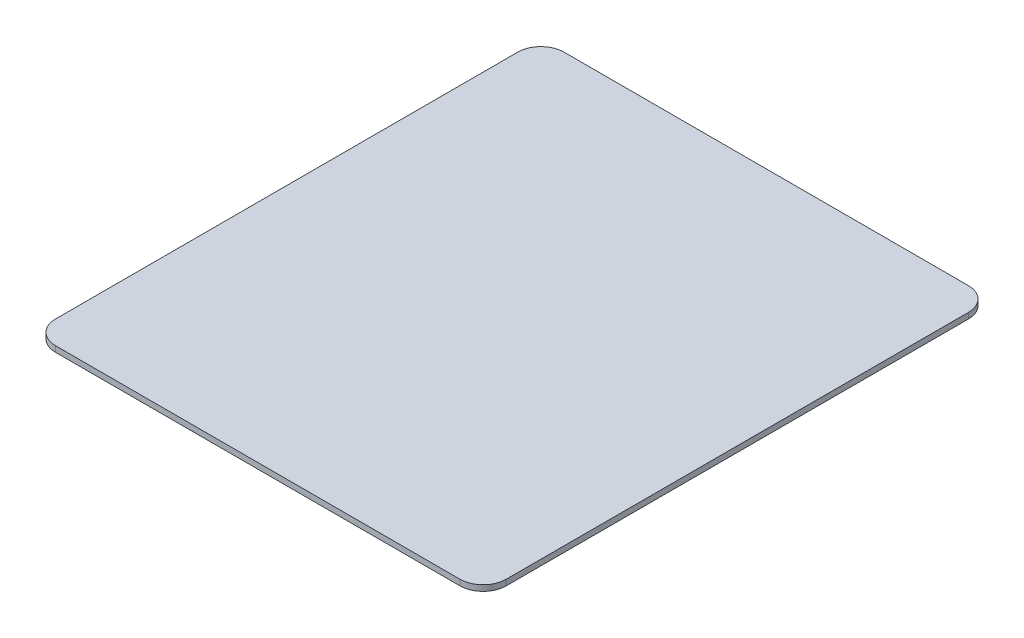
ISO-10303-21;
HEADER;
FILE_DESCRIPTION(('STEP AP214'),'2;1');
FILE_NAME('part.step','',(''),(''),'','','');
FILE_SCHEMA(('AUTOMOTIVE_DESIGN { 1 0 10303 214 1 1 1 1 }'));
ENDSEC;
DATA;
#1=APPLICATION_CONTEXT('core data for automotive mechanical design processes');
#2=APPLICATION_PROTOCOL_DEFINITION('international standard','automotive_design',2000,#1);
#3=PRODUCT_CONTEXT('',#1,'mechanical');
#4=PRODUCT('Part','Part','',(#3));
#5=PRODUCT_RELATED_PRODUCT_CATEGORY('part','',(#4));
#6=PRODUCT_DEFINITION_FORMATION('','',#4);
#7=PRODUCT_DEFINITION_CONTEXT('part definition',#1,'design');
#8=PRODUCT_DEFINITION('design','',#6,#7);
#9=PRODUCT_DEFINITION_SHAPE('','',#8);
#10=(LENGTH_UNIT() NAMED_UNIT(*) SI_UNIT(.MILLI.,.METRE.));
#11=(NAMED_UNIT(*) PLANE_ANGLE_UNIT() SI_UNIT($,.RADIAN.));
#12=(NAMED_UNIT(*) SI_UNIT($,.STERADIAN.) SOLID_ANGLE_UNIT());
#13=UNCERTAINTY_MEASURE_WITH_UNIT(LENGTH_MEASURE(1.E-05),#10,'distance_accuracy_value','');
#14=(GEOMETRIC_REPRESENTATION_CONTEXT(3) GLOBAL_UNCERTAINTY_ASSIGNED_CONTEXT((#13)) GLOBAL_UNIT_ASSIGNED_CONTEXT((#10,
#11,#12)) REPRESENTATION_CONTEXT('',''));
#15=CARTESIAN_POINT('',(0.,0.,0.));
#16=DIRECTION('',(0.,0.,1.));
#17=DIRECTION('',(1.,0.,0.));
#18=AXIS2_PLACEMENT_3D('',#15,#16,#17);
#19=CARTESIAN_POINT('',(0.,0.5,-22.));
#20=DIRECTION('',(0.,0.,1.));
#21=DIRECTION('',(1.,0.,0.));
#22=AXIS2_PLACEMENT_3D('',#19,#20,#21);
#23=PLANE('',#22);
#24=DIRECTION('',(-1.,0.,0.));
#25=VECTOR('',#24,1.);
#26=CARTESIAN_POINT('',(0.,0.,-22.));
#27=LINE('',#26,#25);
#28=CARTESIAN_POINT('',(17.5,0.,-22.));
#29=VERTEX_POINT('',#28);
#30=CARTESIAN_POINT('',(-17.5,0.,-22.));
#31=VERTEX_POINT('',#30);
#32=EDGE_CURVE('E158',#29,#31,#27,.T.);
#33=ORIENTED_EDGE('',*,*,#32,.T.);
#34=DIRECTION('',(0.,-1.,0.));
#35=VECTOR('',#34,1.);
#36=CARTESIAN_POINT('',(-17.5,0.5,-22.));
#37=LINE('',#36,#35);
#38=CARTESIAN_POINT('',(-17.5,0.5,-22.));
#39=VERTEX_POINT('',#38);
#40=EDGE_CURVE('E13',#39,#31,#37,.T.);
#41=ORIENTED_EDGE('',*,*,#40,.F.);
#42=DIRECTION('',(-1.,0.,0.));
#43=VECTOR('',#42,1.);
#44=CARTESIAN_POINT('',(0.,0.5,-22.));
#45=LINE('',#44,#43);
#46=CARTESIAN_POINT('',(17.5,0.5,-22.));
#47=VERTEX_POINT('',#46);
#48=EDGE_CURVE('E184',#47,#39,#45,.T.);
#49=ORIENTED_EDGE('',*,*,#48,.F.);
#50=DIRECTION('',(0.,-1.,0.));
#51=VECTOR('',#50,1.);
#52=CARTESIAN_POINT('',(17.5,0.5,-22.));
#53=LINE('',#52,#51);
#54=EDGE_CURVE('E154',#47,#29,#53,.T.);
#55=ORIENTED_EDGE('',*,*,#54,.T.);
#56=EDGE_LOOP('',(#33,#41,#49,#55));
#57=FACE_BOUND('',#56,.T.);
#58=ADVANCED_FACE('F56',(#57),#23,.F.);
#59=CARTESIAN_POINT('',(-17.5,0.5,-20.));
#60=DIRECTION('',(0.,-1.,0.));
#61=DIRECTION('',(0.,0.,-1.));
#62=AXIS2_PLACEMENT_3D('',#59,#60,#61);
#63=CYLINDRICAL_SURFACE('',#62,2.);
#64=CARTESIAN_POINT('',(-17.5,0.,-20.));
#65=DIRECTION('',(0.,1.,0.));
#66=DIRECTION('',(0.,0.,1.));
#67=AXIS2_PLACEMENT_3D('',#64,#65,#66);
#68=CIRCLE('',#67,2.);
#69=CARTESIAN_POINT('',(-19.5,0.,-20.));
#70=VERTEX_POINT('',#69);
#71=EDGE_CURVE('E162',#31,#70,#68,.T.);
#72=ORIENTED_EDGE('',*,*,#71,.T.);
#73=DIRECTION('',(0.,-1.,0.));
#74=VECTOR('',#73,1.);
#75=CARTESIAN_POINT('',(-19.5,0.5,-20.));
#76=LINE('',#75,#74);
#77=CARTESIAN_POINT('',(-19.5,0.5,-20.));
#78=VERTEX_POINT('',#77);
#79=EDGE_CURVE('E65',#78,#70,#76,.T.);
#80=ORIENTED_EDGE('',*,*,#79,.F.);
#81=CARTESIAN_POINT('',(-17.5,0.5,-20.));
#82=DIRECTION('',(0.,1.,0.));
#83=DIRECTION('',(0.,0.,1.));
#84=AXIS2_PLACEMENT_3D('',#81,#82,#83);
#85=CIRCLE('',#84,2.);
#86=EDGE_CURVE('E116',#39,#78,#85,.T.);
#87=ORIENTED_EDGE('',*,*,#86,.F.);
#88=ORIENTED_EDGE('',*,*,#40,.T.);
#89=EDGE_LOOP('',(#72,#80,#87,#88));
#90=FACE_BOUND('',#89,.T.);
#91=ADVANCED_FACE('F204',(#90),#63,.T.);
#92=CARTESIAN_POINT('',(-19.5,0.5,0.));
#93=DIRECTION('',(-1.,0.,0.));
#94=DIRECTION('',(0.,0.,1.));
#95=AXIS2_PLACEMENT_3D('',#92,#93,#94);
#96=PLANE('',#95);
#97=DIRECTION('',(0.,0.,-1.));
#98=VECTOR('',#97,1.);
#99=CARTESIAN_POINT('',(-19.5,0.,0.));
#100=LINE('',#99,#98);
#101=CARTESIAN_POINT('',(-19.5,0.,20.));
#102=VERTEX_POINT('',#101);
#103=EDGE_CURVE('E166',#102,#70,#100,.T.);
#104=ORIENTED_EDGE('',*,*,#103,.F.);
#105=DIRECTION('',(0.,-1.,0.));
#106=VECTOR('',#105,1.);
#107=CARTESIAN_POINT('',(-19.5,0.5,20.));
#108=LINE('',#107,#106);
#109=CARTESIAN_POINT('',(-19.5,0.5,20.));
#110=VERTEX_POINT('',#109);
#111=EDGE_CURVE('E194',#110,#102,#108,.T.);
#112=ORIENTED_EDGE('',*,*,#111,.F.);
#113=DIRECTION('',(0.,0.,-1.));
#114=VECTOR('',#113,1.);
#115=CARTESIAN_POINT('',(-19.5,0.5,0.));
#116=LINE('',#115,#114);
#117=EDGE_CURVE('E203',#110,#78,#116,.T.);
#118=ORIENTED_EDGE('',*,*,#117,.T.);
#119=ORIENTED_EDGE('',*,*,#79,.T.);
#120=EDGE_LOOP('',(#104,#112,#118,#119));
#121=FACE_BOUND('',#120,.T.);
#122=ADVANCED_FACE('F201',(#121),#96,.T.);
#123=CARTESIAN_POINT('',(-17.5,0.5,20.));
#124=DIRECTION('',(0.,-1.,0.));
#125=DIRECTION('',(0.,0.,-1.));
#126=AXIS2_PLACEMENT_3D('',#123,#124,#125);
#127=CYLINDRICAL_SURFACE('',#126,2.);
#128=CARTESIAN_POINT('',(-17.5,0.,20.));
#129=DIRECTION('',(0.,1.,0.));
#130=DIRECTION('',(0.,0.,1.));
#131=AXIS2_PLACEMENT_3D('',#128,#129,#130);
#132=CIRCLE('',#131,2.);
#133=CARTESIAN_POINT('',(-17.5,0.,22.));
#134=VERTEX_POINT('',#133);
#135=EDGE_CURVE('E170',#134,#102,#132,.F.);
#136=ORIENTED_EDGE('',*,*,#135,.F.);
#137=DIRECTION('',(0.,-1.,0.));
#138=VECTOR('',#137,1.);
#139=CARTESIAN_POINT('',(-17.5,0.5,22.));
#140=LINE('',#139,#138);
#141=CARTESIAN_POINT('',(-17.5,0.5,22.));
#142=VERTEX_POINT('',#141);
#143=EDGE_CURVE('E191',#142,#134,#140,.T.);
#144=ORIENTED_EDGE('',*,*,#143,.F.);
#145=CARTESIAN_POINT('',(-17.5,0.5,20.));
#146=DIRECTION('',(0.,1.,0.));
#147=DIRECTION('',(0.,0.,1.));
#148=AXIS2_PLACEMENT_3D('',#145,#146,#147);
#149=CIRCLE('',#148,2.);
#150=EDGE_CURVE('E214',#142,#110,#149,.F.);
#151=ORIENTED_EDGE('',*,*,#150,.T.);
#152=ORIENTED_EDGE('',*,*,#111,.T.);
#153=EDGE_LOOP('',(#136,#144,#151,#152));
#154=FACE_BOUND('',#153,.T.);
#155=ADVANCED_FACE('F212',(#154),#127,.T.);
#156=CARTESIAN_POINT('',(0.,0.5,22.));
#157=DIRECTION('',(0.,0.,1.));
#158=DIRECTION('',(1.,0.,0.));
#159=AXIS2_PLACEMENT_3D('',#156,#157,#158);
#160=PLANE('',#159);
#161=DIRECTION('',(-1.,0.,0.));
#162=VECTOR('',#161,1.);
#163=CARTESIAN_POINT('',(0.,0.,22.));
#164=LINE('',#163,#162);
#165=CARTESIAN_POINT('',(17.5,0.,22.));
#166=VERTEX_POINT('',#165);
#167=EDGE_CURVE('E174',#166,#134,#164,.T.);
#168=ORIENTED_EDGE('',*,*,#167,.F.);
#169=DIRECTION('',(0.,-1.,0.));
#170=VECTOR('',#169,1.);
#171=CARTESIAN_POINT('',(17.5,0.5,22.));
#172=LINE('',#171,#170);
#173=CARTESIAN_POINT('',(17.5,0.5,22.));
#174=VERTEX_POINT('',#173);
#175=EDGE_CURVE('E146',#174,#166,#172,.T.);
#176=ORIENTED_EDGE('',*,*,#175,.F.);
#177=DIRECTION('',(-1.,0.,0.));
#178=VECTOR('',#177,1.);
#179=CARTESIAN_POINT('',(0.,0.5,22.));
#180=LINE('',#179,#178);
#181=EDGE_CURVE('E137',#174,#142,#180,.T.);
#182=ORIENTED_EDGE('',*,*,#181,.T.);
#183=ORIENTED_EDGE('',*,*,#143,.T.);
#184=EDGE_LOOP('',(#168,#176,#182,#183));
#185=FACE_BOUND('',#184,.T.);
#186=ADVANCED_FACE('F226',(#185),#160,.T.);
#187=CARTESIAN_POINT('',(17.5,0.5,20.));
#188=DIRECTION('',(0.,-1.,0.));
#189=DIRECTION('',(0.,0.,-1.));
#190=AXIS2_PLACEMENT_3D('',#187,#188,#189);
#191=CYLINDRICAL_SURFACE('',#190,2.);
#192=CARTESIAN_POINT('',(17.5,0.,20.));
#193=DIRECTION('',(0.,1.,0.));
#194=DIRECTION('',(0.,0.,1.));
#195=AXIS2_PLACEMENT_3D('',#192,#193,#194);
#196=CIRCLE('',#195,2.);
#197=CARTESIAN_POINT('',(19.5,0.,20.));
#198=VERTEX_POINT('',#197);
#199=EDGE_CURVE('E144',#166,#198,#196,.T.);
#200=ORIENTED_EDGE('',*,*,#199,.T.);
#201=DIRECTION('',(0.,-1.,0.));
#202=VECTOR('',#201,1.);
#203=CARTESIAN_POINT('',(19.5,0.5,20.));
#204=LINE('',#203,#202);
#205=CARTESIAN_POINT('',(19.5,0.5,20.));
#206=VERTEX_POINT('',#205);
#207=EDGE_CURVE('E141',#206,#198,#204,.T.);
#208=ORIENTED_EDGE('',*,*,#207,.F.);
#209=CARTESIAN_POINT('',(17.5,0.5,20.));
#210=DIRECTION('',(0.,1.,0.));
#211=DIRECTION('',(0.,0.,1.));
#212=AXIS2_PLACEMENT_3D('',#209,#210,#211);
#213=CIRCLE('',#212,2.);
#214=EDGE_CURVE('E130',#174,#206,#213,.T.);
#215=ORIENTED_EDGE('',*,*,#214,.F.);
#216=ORIENTED_EDGE('',*,*,#175,.T.);
#217=EDGE_LOOP('',(#200,#208,#215,#216));
#218=FACE_BOUND('',#217,.T.);
#219=ADVANCED_FACE('F142',(#218),#191,.T.);
#220=CARTESIAN_POINT('',(19.5,0.5,0.));
#221=DIRECTION('',(-1.,0.,0.));
#222=DIRECTION('',(0.,0.,1.));
#223=AXIS2_PLACEMENT_3D('',#220,#221,#222);
#224=PLANE('',#223);
#225=DIRECTION('',(0.,0.,-1.));
#226=VECTOR('',#225,1.);
#227=CARTESIAN_POINT('',(19.5,0.,0.));
#228=LINE('',#227,#226);
#229=CARTESIAN_POINT('',(19.5,0.,-20.));
#230=VERTEX_POINT('',#229);
#231=EDGE_CURVE('E102',#198,#230,#228,.T.);
#232=ORIENTED_EDGE('',*,*,#231,.T.);
#233=DIRECTION('',(0.,-1.,0.));
#234=VECTOR('',#233,1.);
#235=CARTESIAN_POINT('',(19.5,0.5,-20.));
#236=LINE('',#235,#234);
#237=CARTESIAN_POINT('',(19.5,0.5,-20.));
#238=VERTEX_POINT('',#237);
#239=EDGE_CURVE('E147',#238,#230,#236,.T.);
#240=ORIENTED_EDGE('',*,*,#239,.F.);
#241=DIRECTION('',(0.,0.,-1.));
#242=VECTOR('',#241,1.);
#243=CARTESIAN_POINT('',(19.5,0.5,0.));
#244=LINE('',#243,#242);
#245=EDGE_CURVE('E134',#206,#238,#244,.T.);
#246=ORIENTED_EDGE('',*,*,#245,.F.);
#247=ORIENTED_EDGE('',*,*,#207,.T.);
#248=EDGE_LOOP('',(#232,#240,#246,#247));
#249=FACE_BOUND('',#248,.T.);
#250=ADVANCED_FACE('F149',(#249),#224,.F.);
#251=CARTESIAN_POINT('',(17.5,0.5,-20.));
#252=DIRECTION('',(0.,-1.,0.));
#253=DIRECTION('',(0.,0.,-1.));
#254=AXIS2_PLACEMENT_3D('',#251,#252,#253);
#255=CYLINDRICAL_SURFACE('',#254,2.);
#256=CARTESIAN_POINT('',(17.5,0.,-20.));
#257=DIRECTION('',(0.,1.,0.));
#258=DIRECTION('',(0.,0.,1.));
#259=AXIS2_PLACEMENT_3D('',#256,#257,#258);
#260=CIRCLE('',#259,2.);
#261=EDGE_CURVE('E108',#230,#29,#260,.T.);
#262=ORIENTED_EDGE('',*,*,#261,.T.);
#263=ORIENTED_EDGE('',*,*,#54,.F.);
#264=CARTESIAN_POINT('',(17.5,0.5,-20.));
#265=DIRECTION('',(0.,1.,0.));
#266=DIRECTION('',(0.,0.,1.));
#267=AXIS2_PLACEMENT_3D('',#264,#265,#266);
#268=CIRCLE('',#267,2.);
#269=EDGE_CURVE('E73',#238,#47,#268,.T.);
#270=ORIENTED_EDGE('',*,*,#269,.F.);
#271=ORIENTED_EDGE('',*,*,#239,.T.);
#272=EDGE_LOOP('',(#262,#263,#270,#271));
#273=FACE_BOUND('',#272,.T.);
#274=ADVANCED_FACE('F229',(#273),#255,.T.);
#275=CARTESIAN_POINT('',(0.,0.5,0.));
#276=DIRECTION('',(0.,1.,0.));
#277=DIRECTION('',(0.,0.,1.));
#278=AXIS2_PLACEMENT_3D('',#275,#276,#277);
#279=PLANE('',#278);
#280=ORIENTED_EDGE('',*,*,#48,.T.);
#281=ORIENTED_EDGE('',*,*,#86,.T.);
#282=ORIENTED_EDGE('',*,*,#117,.F.);
#283=ORIENTED_EDGE('',*,*,#150,.F.);
#284=ORIENTED_EDGE('',*,*,#181,.F.);
#285=ORIENTED_EDGE('',*,*,#214,.T.);
#286=ORIENTED_EDGE('',*,*,#245,.T.);
#287=ORIENTED_EDGE('',*,*,#269,.T.);
#288=EDGE_LOOP('',(#280,#281,#282,#283,#284,#285,#286,#287));
#289=FACE_BOUND('',#288,.T.);
#290=ADVANCED_FACE('F132',(#289),#279,.T.);
#291=CARTESIAN_POINT('',(0.,0.,0.));
#292=DIRECTION('',(0.,1.,0.));
#293=DIRECTION('',(0.,0.,1.));
#294=AXIS2_PLACEMENT_3D('',#291,#292,#293);
#295=PLANE('',#294);
#296=ORIENTED_EDGE('',*,*,#32,.F.);
#297=ORIENTED_EDGE('',*,*,#261,.F.);
#298=ORIENTED_EDGE('',*,*,#231,.F.);
#299=ORIENTED_EDGE('',*,*,#199,.F.);
#300=ORIENTED_EDGE('',*,*,#167,.T.);
#301=ORIENTED_EDGE('',*,*,#135,.T.);
#302=ORIENTED_EDGE('',*,*,#103,.T.);
#303=ORIENTED_EDGE('',*,*,#71,.F.);
#304=EDGE_LOOP('',(#296,#297,#298,#299,#300,#301,#302,#303));
#305=FACE_BOUND('',#304,.T.);
#306=ADVANCED_FACE('F208',(#305),#295,.F.);
#307=CLOSED_SHELL('',(#58,#91,#122,#155,#186,#219,#250,#274,#290,#306));
#308=MANIFOLD_SOLID_BREP('B2',#307);
#309=ADVANCED_BREP_SHAPE_REPRESENTATION('',(#18,#308),#14);
#310=SHAPE_DEFINITION_REPRESENTATION(#9,#309);
ENDSEC;
END-ISO-10303-21;
